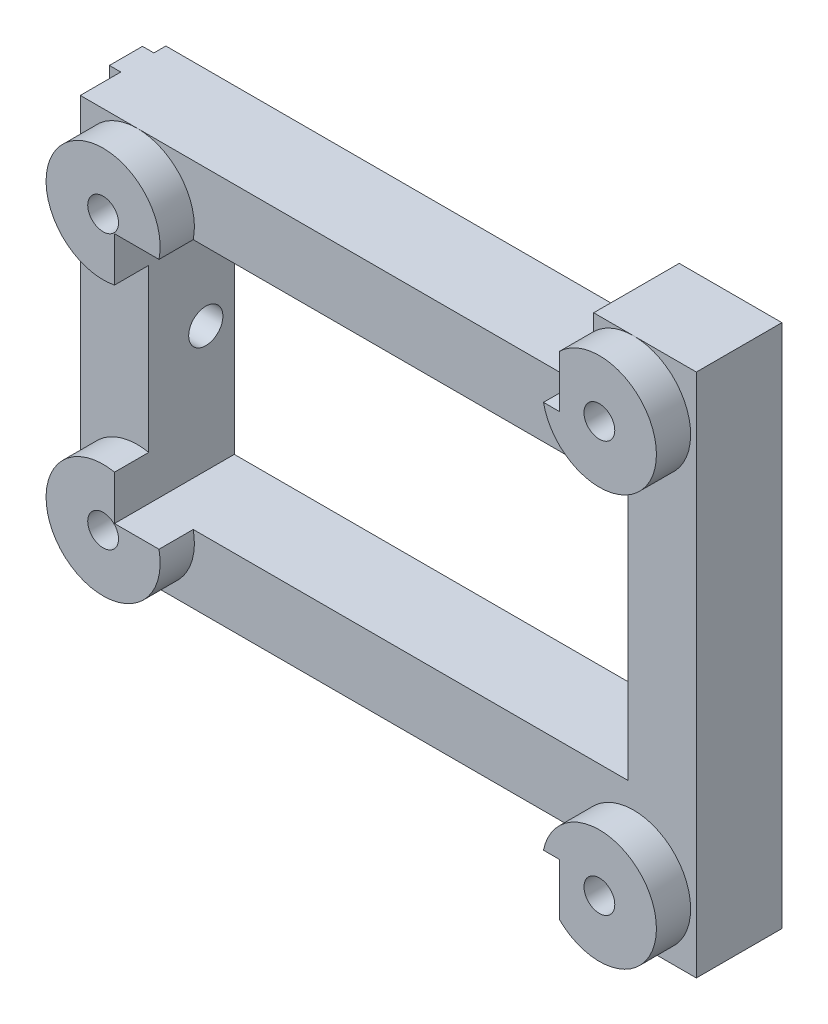
ISO-10303-21;
HEADER;
FILE_DESCRIPTION(('STEP AP214'),'2;1');
FILE_NAME('part.step','',(''),(''),'','','');
FILE_SCHEMA(('AUTOMOTIVE_DESIGN { 1 0 10303 214 1 1 1 1 }'));
ENDSEC;
DATA;
#1=APPLICATION_CONTEXT('core data for automotive mechanical design processes');
#2=APPLICATION_PROTOCOL_DEFINITION('international standard','automotive_design',2000,#1);
#3=PRODUCT_CONTEXT('',#1,'mechanical');
#4=PRODUCT('Part','Part','',(#3));
#5=PRODUCT_RELATED_PRODUCT_CATEGORY('part','',(#4));
#6=PRODUCT_DEFINITION_FORMATION('','',#4);
#7=PRODUCT_DEFINITION_CONTEXT('part definition',#1,'design');
#8=PRODUCT_DEFINITION('design','',#6,#7);
#9=PRODUCT_DEFINITION_SHAPE('','',#8);
#10=(LENGTH_UNIT() NAMED_UNIT(*) SI_UNIT(.MILLI.,.METRE.));
#11=(NAMED_UNIT(*) PLANE_ANGLE_UNIT() SI_UNIT($,.RADIAN.));
#12=(NAMED_UNIT(*) SI_UNIT($,.STERADIAN.) SOLID_ANGLE_UNIT());
#13=UNCERTAINTY_MEASURE_WITH_UNIT(LENGTH_MEASURE(1.E-05),#10,'distance_accuracy_value','');
#14=(GEOMETRIC_REPRESENTATION_CONTEXT(3) GLOBAL_UNCERTAINTY_ASSIGNED_CONTEXT((#13)) GLOBAL_UNIT_ASSIGNED_CONTEXT((#10,
#11,#12)) REPRESENTATION_CONTEXT('',''));
#15=CARTESIAN_POINT('',(0.,0.,0.));
#16=DIRECTION('',(0.,0.,1.));
#17=DIRECTION('',(1.,0.,0.));
#18=AXIS2_PLACEMENT_3D('',#15,#16,#17);
#19=CARTESIAN_POINT('',(-28.,17.,1.05));
#20=DIRECTION('',(0.,0.,1.));
#21=DIRECTION('',(0.,-1.,0.));
#22=AXIS2_PLACEMENT_3D('',#19,#20,#21);
#23=PLANE('',#22);
#24=DIRECTION('',(0.,-1.,0.));
#25=VECTOR('',#24,1.);
#26=CARTESIAN_POINT('',(-27.,17.,1.05));
#27=LINE('',#26,#25);
#28=CARTESIAN_POINT('',(-27.,17.,1.05));
#29=VERTEX_POINT('',#28);
#30=CARTESIAN_POINT('',(-27.,0.384057287393442,1.05));
#31=VERTEX_POINT('',#30);
#32=EDGE_CURVE('E250',#29,#31,#27,.T.);
#33=ORIENTED_EDGE('',*,*,#32,.T.);
#34=DIRECTION('',(-1.,0.,0.));
#35=VECTOR('',#34,1.);
#36=CARTESIAN_POINT('',(27.001,0.384057287393442,1.05));
#37=LINE('',#36,#35);
#38=CARTESIAN_POINT('',(-28.,0.384057287393443,1.05));
#39=VERTEX_POINT('',#38);
#40=EDGE_CURVE('E235',#39,#31,#37,.F.);
#41=ORIENTED_EDGE('',*,*,#40,.F.);
#42=DIRECTION('',(0.,-1.,0.));
#43=VECTOR('',#42,1.);
#44=CARTESIAN_POINT('',(-28.,17.,1.05));
#45=LINE('',#44,#43);
#46=CARTESIAN_POINT('',(-28.,17.,1.05));
#47=VERTEX_POINT('',#46);
#48=EDGE_CURVE('E458',#47,#39,#45,.T.);
#49=ORIENTED_EDGE('',*,*,#48,.F.);
#50=DIRECTION('',(1.,0.,0.));
#51=VECTOR('',#50,1.);
#52=CARTESIAN_POINT('',(-28.,17.,1.05));
#53=LINE('',#52,#51);
#54=EDGE_CURVE('E257',#47,#29,#53,.T.);
#55=ORIENTED_EDGE('',*,*,#54,.T.);
#56=EDGE_LOOP('',(#33,#41,#49,#55));
#57=FACE_BOUND('',#56,.T.);
#58=ADVANCED_FACE('F33',(#57),#23,.F.);
#59=CARTESIAN_POINT('',(-28.,17.,3.95));
#60=DIRECTION('',(0.,0.,-1.));
#61=DIRECTION('',(0.,1.,0.));
#62=AXIS2_PLACEMENT_3D('',#59,#60,#61);
#63=PLANE('',#62);
#64=DIRECTION('',(0.,1.,0.));
#65=VECTOR('',#64,1.);
#66=CARTESIAN_POINT('',(-27.,17.,3.95));
#67=LINE('',#66,#65);
#68=CARTESIAN_POINT('',(-27.,-17.,3.95));
#69=VERTEX_POINT('',#68);
#70=CARTESIAN_POINT('',(-27.,-0.384057287393425,3.95));
#71=VERTEX_POINT('',#70);
#72=EDGE_CURVE('E260',#69,#71,#67,.T.);
#73=ORIENTED_EDGE('',*,*,#72,.T.);
#74=DIRECTION('',(-1.,0.,0.));
#75=VECTOR('',#74,1.);
#76=CARTESIAN_POINT('',(27.001,-0.384057287393427,3.95));
#77=LINE('',#76,#75);
#78=CARTESIAN_POINT('',(-28.,-0.384057287393425,3.95));
#79=VERTEX_POINT('',#78);
#80=EDGE_CURVE('E499',#79,#71,#77,.F.);
#81=ORIENTED_EDGE('',*,*,#80,.F.);
#82=DIRECTION('',(0.,1.,0.));
#83=VECTOR('',#82,1.);
#84=CARTESIAN_POINT('',(-28.,17.,3.95));
#85=LINE('',#84,#83);
#86=CARTESIAN_POINT('',(-28.,-17.,3.95));
#87=VERTEX_POINT('',#86);
#88=EDGE_CURVE('E462',#87,#79,#85,.T.);
#89=ORIENTED_EDGE('',*,*,#88,.F.);
#90=DIRECTION('',(1.,0.,0.));
#91=VECTOR('',#90,1.);
#92=CARTESIAN_POINT('',(-28.,-17.,3.95));
#93=LINE('',#92,#91);
#94=EDGE_CURVE('E273',#87,#69,#93,.T.);
#95=ORIENTED_EDGE('',*,*,#94,.T.);
#96=EDGE_LOOP('',(#73,#81,#89,#95));
#97=FACE_BOUND('',#96,.T.);
#98=ADVANCED_FACE('F552',(#97),#63,.F.);
#99=CARTESIAN_POINT('',(-28.,0.,0.));
#100=DIRECTION('',(-1.,0.,0.));
#101=DIRECTION('',(0.,0.,1.));
#102=AXIS2_PLACEMENT_3D('',#99,#100,#101);
#103=PLANE('',#102);
#104=CARTESIAN_POINT('',(-28.,0.,2.5));
#105=DIRECTION('',(-1.,0.,0.));
#106=DIRECTION('',(0.,0.,1.));
#107=AXIS2_PLACEMENT_3D('',#104,#105,#106);
#108=CIRCLE('',#107,1.5);
#109=CARTESIAN_POINT('',(-28.,0.384057287393427,3.95));
#110=VERTEX_POINT('',#109);
#111=EDGE_CURVE('E240',#110,#39,#108,.T.);
#112=ORIENTED_EDGE('',*,*,#111,.F.);
#113=CARTESIAN_POINT('',(-28.,17.,3.95));
#114=VERTEX_POINT('',#113);
#115=EDGE_CURVE('E461',#110,#114,#85,.T.);
#116=ORIENTED_EDGE('',*,*,#115,.T.);
#117=DIRECTION('',(0.,0.,-1.));
#118=VECTOR('',#117,1.);
#119=CARTESIAN_POINT('',(-28.,17.,1.05));
#120=LINE('',#119,#118);
#121=EDGE_CURVE('E264',#114,#47,#120,.T.);
#122=ORIENTED_EDGE('',*,*,#121,.T.);
#123=ORIENTED_EDGE('',*,*,#48,.T.);
#124=EDGE_LOOP('',(#112,#116,#122,#123));
#125=FACE_BOUND('',#124,.T.);
#126=ADVANCED_FACE('F469',(#125),#103,.T.);
#127=CARTESIAN_POINT('',(0.,0.,7.5));
#128=DIRECTION('',(0.,0.,-1.));
#129=DIRECTION('',(-1.,0.,0.));
#130=AXIS2_PLACEMENT_3D('',#127,#128,#129);
#131=PLANE('',#130);
#132=CARTESIAN_POINT('',(-22.,-12.,7.5));
#133=DIRECTION('',(0.,0.,1.));
#134=DIRECTION('',(1.,0.,0.));
#135=AXIS2_PLACEMENT_3D('',#132,#133,#134);
#136=CIRCLE('',#135,5.);
#137=CARTESIAN_POINT('',(-21.,-7.10102051443364,7.5));
#138=VERTEX_POINT('',#137);
#139=CARTESIAN_POINT('',(-27.,-12.,7.5));
#140=VERTEX_POINT('',#139);
#141=EDGE_CURVE('E346',#138,#140,#136,.T.);
#142=ORIENTED_EDGE('',*,*,#141,.F.);
#143=DIRECTION('',(0.,1.,0.));
#144=VECTOR('',#143,1.);
#145=CARTESIAN_POINT('',(-21.,0.,7.5));
#146=LINE('',#145,#144);
#147=CARTESIAN_POINT('',(-21.,7.10102051443364,7.5));
#148=VERTEX_POINT('',#147);
#149=EDGE_CURVE('E443',#138,#148,#146,.T.);
#150=ORIENTED_EDGE('',*,*,#149,.T.);
#151=CARTESIAN_POINT('',(-22.,12.,7.5));
#152=DIRECTION('',(0.,0.,1.));
#153=DIRECTION('',(1.,0.,0.));
#154=AXIS2_PLACEMENT_3D('',#151,#152,#153);
#155=CIRCLE('',#154,5.);
#156=CARTESIAN_POINT('',(-27.,12.,7.5));
#157=VERTEX_POINT('',#156);
#158=EDGE_CURVE('E362',#157,#148,#155,.T.);
#159=ORIENTED_EDGE('',*,*,#158,.F.);
#160=DIRECTION('',(0.,-1.,0.));
#161=VECTOR('',#160,1.);
#162=CARTESIAN_POINT('',(-27.,-23.,7.5));
#163=LINE('',#162,#161);
#164=EDGE_CURVE('E381',#157,#140,#163,.T.);
#165=ORIENTED_EDGE('',*,*,#164,.T.);
#166=EDGE_LOOP('',(#142,#150,#159,#165));
#167=FACE_BOUND('',#166,.T.);
#168=ADVANCED_FACE('F548',(#167),#131,.F.);
#169=CARTESIAN_POINT('',(-27.,-23.,7.5));
#170=DIRECTION('',(1.,0.,0.));
#171=DIRECTION('',(0.,0.,-1.));
#172=AXIS2_PLACEMENT_3D('',#169,#170,#171);
#173=PLANE('',#172);
#174=CARTESIAN_POINT('',(-27.,-0.384057287393442,1.05));
#175=VERTEX_POINT('',#174);
#176=CARTESIAN_POINT('',(-27.,-17.,1.05));
#177=VERTEX_POINT('',#176);
#178=EDGE_CURVE('E253',#175,#177,#27,.T.);
#179=ORIENTED_EDGE('',*,*,#178,.F.);
#180=CARTESIAN_POINT('',(-27.,0.,2.5));
#181=DIRECTION('',(1.,0.,0.));
#182=DIRECTION('',(0.,0.,-1.));
#183=AXIS2_PLACEMENT_3D('',#180,#181,#182);
#184=CIRCLE('',#183,1.5);
#185=EDGE_CURVE('E238',#31,#175,#184,.F.);
#186=ORIENTED_EDGE('',*,*,#185,.F.);
#187=ORIENTED_EDGE('',*,*,#32,.F.);
#188=DIRECTION('',(0.,0.,1.));
#189=VECTOR('',#188,1.);
#190=CARTESIAN_POINT('',(-27.,17.,0.));
#191=LINE('',#190,#189);
#192=CARTESIAN_POINT('',(-27.,17.,0.));
#193=VERTEX_POINT('',#192);
#194=EDGE_CURVE('E279',#193,#29,#191,.T.);
#195=ORIENTED_EDGE('',*,*,#194,.F.);
#196=DIRECTION('',(0.,-1.,0.));
#197=VECTOR('',#196,1.);
#198=CARTESIAN_POINT('',(-27.,-23.,0.));
#199=LINE('',#198,#197);
#200=CARTESIAN_POINT('',(-27.,-17.,0.));
#201=VERTEX_POINT('',#200);
#202=EDGE_CURVE('E377',#193,#201,#199,.T.);
#203=ORIENTED_EDGE('',*,*,#202,.T.);
#204=DIRECTION('',(0.,0.,-1.));
#205=VECTOR('',#204,1.);
#206=CARTESIAN_POINT('',(-27.,-17.,10.5));
#207=LINE('',#206,#205);
#208=EDGE_CURVE('E309',#177,#201,#207,.T.);
#209=ORIENTED_EDGE('',*,*,#208,.F.);
#210=EDGE_LOOP('',(#179,#186,#187,#195,#203,#209));
#211=FACE_BOUND('',#210,.T.);
#212=ADVANCED_FACE('F35',(#211),#173,.F.);
#213=CARTESIAN_POINT('',(-27.,0.384057287393427,3.95));
#214=VERTEX_POINT('',#213);
#215=CARTESIAN_POINT('',(-27.,17.,3.95));
#216=VERTEX_POINT('',#215);
#217=EDGE_CURVE('E258',#214,#216,#67,.T.);
#218=ORIENTED_EDGE('',*,*,#217,.F.);
#219=CARTESIAN_POINT('',(-27.,0.,2.5));
#220=DIRECTION('',(1.,0.,0.));
#221=DIRECTION('',(0.,0.,-1.));
#222=AXIS2_PLACEMENT_3D('',#219,#220,#221);
#223=CIRCLE('',#222,1.5);
#224=EDGE_CURVE('E504',#71,#214,#223,.F.);
#225=ORIENTED_EDGE('',*,*,#224,.F.);
#226=ORIENTED_EDGE('',*,*,#72,.F.);
#227=CARTESIAN_POINT('',(-27.,-17.,7.5));
#228=VERTEX_POINT('',#227);
#229=EDGE_CURVE('E310',#228,#69,#207,.T.);
#230=ORIENTED_EDGE('',*,*,#229,.F.);
#231=EDGE_CURVE('E382',#140,#228,#163,.T.);
#232=ORIENTED_EDGE('',*,*,#231,.F.);
#233=ORIENTED_EDGE('',*,*,#164,.F.);
#234=CARTESIAN_POINT('',(-27.,17.,7.5));
#235=VERTEX_POINT('',#234);
#236=EDGE_CURVE('E378',#235,#157,#163,.T.);
#237=ORIENTED_EDGE('',*,*,#236,.F.);
#238=EDGE_CURVE('E282',#216,#235,#191,.T.);
#239=ORIENTED_EDGE('',*,*,#238,.F.);
#240=EDGE_LOOP('',(#218,#225,#226,#230,#232,#233,#237,#239));
#241=FACE_BOUND('',#240,.T.);
#242=ADVANCED_FACE('F639',(#241),#173,.F.);
#243=DIRECTION('',(1.,0.,0.));
#244=VECTOR('',#243,1.);
#245=CARTESIAN_POINT('',(0.,17.,7.5));
#246=LINE('',#245,#244);
#247=CARTESIAN_POINT('',(-22.,17.,7.5));
#248=VERTEX_POINT('',#247);
#249=EDGE_CURVE('E297',#235,#248,#246,.T.);
#250=ORIENTED_EDGE('',*,*,#249,.F.);
#251=ORIENTED_EDGE('',*,*,#236,.T.);
#252=EDGE_CURVE('E353',#248,#157,#155,.T.);
#253=ORIENTED_EDGE('',*,*,#252,.F.);
#254=EDGE_LOOP('',(#250,#251,#253));
#255=FACE_BOUND('',#254,.T.);
#256=ADVANCED_FACE('F655',(#255),#131,.F.);
#257=CARTESIAN_POINT('',(-17.1010205144336,11.,7.5));
#258=VERTEX_POINT('',#257);
#259=EDGE_CURVE('E365',#258,#248,#155,.T.);
#260=ORIENTED_EDGE('',*,*,#259,.F.);
#261=DIRECTION('',(1.,0.,0.));
#262=VECTOR('',#261,1.);
#263=CARTESIAN_POINT('',(0.,11.,7.5));
#264=LINE('',#263,#262);
#265=CARTESIAN_POINT('',(21.,11.,7.5));
#266=VERTEX_POINT('',#265);
#267=EDGE_CURVE('E453',#258,#266,#264,.T.);
#268=ORIENTED_EDGE('',*,*,#267,.T.);
#269=DIRECTION('',(0.,-1.,0.));
#270=VECTOR('',#269,1.);
#271=CARTESIAN_POINT('',(21.,0.,7.5));
#272=LINE('',#271,#270);
#273=CARTESIAN_POINT('',(21.,-11.,7.5));
#274=VERTEX_POINT('',#273);
#275=EDGE_CURVE('E262',#266,#274,#272,.T.);
#276=ORIENTED_EDGE('',*,*,#275,.T.);
#277=DIRECTION('',(-1.,0.,0.));
#278=VECTOR('',#277,1.);
#279=CARTESIAN_POINT('',(0.,-11.,7.5));
#280=LINE('',#279,#278);
#281=CARTESIAN_POINT('',(-17.1010205144336,-11.,7.5));
#282=VERTEX_POINT('',#281);
#283=EDGE_CURVE('E432',#274,#282,#280,.T.);
#284=ORIENTED_EDGE('',*,*,#283,.T.);
#285=CARTESIAN_POINT('',(-22.,-17.,7.5));
#286=VERTEX_POINT('',#285);
#287=EDGE_CURVE('E357',#286,#282,#136,.T.);
#288=ORIENTED_EDGE('',*,*,#287,.F.);
#289=DIRECTION('',(1.,0.,0.));
#290=VECTOR('',#289,1.);
#291=CARTESIAN_POINT('',(0.,-17.,7.5));
#292=LINE('',#291,#290);
#293=CARTESIAN_POINT('',(16.6010205144336,-17.,7.5));
#294=VERTEX_POINT('',#293);
#295=EDGE_CURVE('E325',#286,#294,#292,.T.);
#296=ORIENTED_EDGE('',*,*,#295,.T.);
#297=CARTESIAN_POINT('',(21.5,-18.,7.5));
#298=DIRECTION('',(0.,0.,1.));
#299=DIRECTION('',(1.,0.,0.));
#300=AXIS2_PLACEMENT_3D('',#297,#298,#299);
#301=CIRCLE('',#300,5.);
#302=CARTESIAN_POINT('',(21.5,-23.,7.5));
#303=VERTEX_POINT('',#302);
#304=EDGE_CURVE('E347',#303,#294,#301,.T.);
#305=ORIENTED_EDGE('',*,*,#304,.F.);
#306=DIRECTION('',(1.,0.,0.));
#307=VECTOR('',#306,1.);
#308=CARTESIAN_POINT('',(-27.,-23.,7.5));
#309=LINE('',#308,#307);
#310=CARTESIAN_POINT('',(27.,-23.,7.5));
#311=VERTEX_POINT('',#310);
#312=EDGE_CURVE('E380',#303,#311,#309,.T.);
#313=ORIENTED_EDGE('',*,*,#312,.T.);
#314=DIRECTION('',(0.,1.,0.));
#315=VECTOR('',#314,1.);
#316=CARTESIAN_POINT('',(27.,-23.,7.5));
#317=LINE('',#316,#315);
#318=CARTESIAN_POINT('',(27.,23.,7.5));
#319=VERTEX_POINT('',#318);
#320=EDGE_CURVE('E385',#311,#319,#317,.T.);
#321=ORIENTED_EDGE('',*,*,#320,.T.);
#322=DIRECTION('',(-1.,0.,0.));
#323=VECTOR('',#322,1.);
#324=CARTESIAN_POINT('',(-27.,23.,7.5));
#325=LINE('',#324,#323);
#326=CARTESIAN_POINT('',(21.5,23.,7.5));
#327=VERTEX_POINT('',#326);
#328=EDGE_CURVE('E388',#319,#327,#325,.T.);
#329=ORIENTED_EDGE('',*,*,#328,.T.);
#330=CARTESIAN_POINT('',(21.5,18.,7.5));
#331=DIRECTION('',(0.,0.,1.));
#332=DIRECTION('',(1.,0.,0.));
#333=AXIS2_PLACEMENT_3D('',#330,#331,#332);
#334=CIRCLE('',#333,5.);
#335=CARTESIAN_POINT('',(16.6010205144336,17.,7.5));
#336=VERTEX_POINT('',#335);
#337=EDGE_CURVE('E335',#336,#327,#334,.T.);
#338=ORIENTED_EDGE('',*,*,#337,.F.);
#339=EDGE_CURVE('E295',#248,#336,#246,.T.);
#340=ORIENTED_EDGE('',*,*,#339,.F.);
#341=EDGE_LOOP('',(#260,#268,#276,#284,#288,#296,#305,#313,#321,#329,#338,#340));
#342=FACE_BOUND('',#341,.T.);
#343=ADVANCED_FACE('F520',(#342),#131,.F.);
#344=CARTESIAN_POINT('',(18.,-21.5707142142714,7.5));
#345=VERTEX_POINT('',#344);
#346=EDGE_CURVE('E339',#345,#303,#301,.T.);
#347=ORIENTED_EDGE('',*,*,#346,.F.);
#348=DIRECTION('',(0.,-1.,0.));
#349=VECTOR('',#348,1.);
#350=CARTESIAN_POINT('',(18.,0.,7.5));
#351=LINE('',#350,#349);
#352=CARTESIAN_POINT('',(18.,-23.,7.5));
#353=VERTEX_POINT('',#352);
#354=EDGE_CURVE('E332',#345,#353,#351,.T.);
#355=ORIENTED_EDGE('',*,*,#354,.T.);
#356=EDGE_CURVE('E383',#353,#303,#309,.T.);
#357=ORIENTED_EDGE('',*,*,#356,.T.);
#358=EDGE_LOOP('',(#347,#355,#357));
#359=FACE_BOUND('',#358,.T.);
#360=ADVANCED_FACE('F682',(#359),#131,.F.);
#361=ORIENTED_EDGE('',*,*,#231,.T.);
#362=EDGE_CURVE('E328',#228,#286,#292,.T.);
#363=ORIENTED_EDGE('',*,*,#362,.T.);
#364=EDGE_CURVE('E354',#140,#286,#136,.T.);
#365=ORIENTED_EDGE('',*,*,#364,.F.);
#366=EDGE_LOOP('',(#361,#363,#365));
#367=FACE_BOUND('',#366,.T.);
#368=ADVANCED_FACE('F549',(#367),#131,.F.);
#369=CARTESIAN_POINT('',(-27.,-23.,7.5));
#370=DIRECTION('',(0.,1.,0.));
#371=DIRECTION('',(0.,0.,1.));
#372=AXIS2_PLACEMENT_3D('',#369,#370,#371);
#373=PLANE('',#372);
#374=ORIENTED_EDGE('',*,*,#356,.F.);
#375=DIRECTION('',(0.,0.,1.));
#376=VECTOR('',#375,1.);
#377=CARTESIAN_POINT('',(18.,-23.,10.5));
#378=LINE('',#377,#376);
#379=CARTESIAN_POINT('',(18.,-23.,0.));
#380=VERTEX_POINT('',#379);
#381=EDGE_CURVE('E304',#380,#353,#378,.T.);
#382=ORIENTED_EDGE('',*,*,#381,.F.);
#383=DIRECTION('',(1.,0.,0.));
#384=VECTOR('',#383,1.);
#385=CARTESIAN_POINT('',(-27.,-23.,0.));
#386=LINE('',#385,#384);
#387=CARTESIAN_POINT('',(27.,-23.,0.));
#388=VERTEX_POINT('',#387);
#389=EDGE_CURVE('E394',#380,#388,#386,.T.);
#390=ORIENTED_EDGE('',*,*,#389,.T.);
#391=DIRECTION('',(0.,0.,-1.));
#392=VECTOR('',#391,1.);
#393=CARTESIAN_POINT('',(27.,-23.,7.5));
#394=LINE('',#393,#392);
#395=EDGE_CURVE('E403',#311,#388,#394,.T.);
#396=ORIENTED_EDGE('',*,*,#395,.F.);
#397=ORIENTED_EDGE('',*,*,#312,.F.);
#398=EDGE_LOOP('',(#374,#382,#390,#396,#397));
#399=FACE_BOUND('',#398,.T.);
#400=ADVANCED_FACE('F678',(#399),#373,.F.);
#401=CARTESIAN_POINT('',(27.,-23.,7.5));
#402=DIRECTION('',(-1.,0.,0.));
#403=DIRECTION('',(0.,0.,1.));
#404=AXIS2_PLACEMENT_3D('',#401,#402,#403);
#405=PLANE('',#404);
#406=DIRECTION('',(0.,1.,0.));
#407=VECTOR('',#406,1.);
#408=CARTESIAN_POINT('',(27.,-23.,0.));
#409=LINE('',#408,#407);
#410=CARTESIAN_POINT('',(27.,23.,0.));
#411=VERTEX_POINT('',#410);
#412=EDGE_CURVE('E396',#388,#411,#409,.T.);
#413=ORIENTED_EDGE('',*,*,#412,.T.);
#414=DIRECTION('',(0.,0.,-1.));
#415=VECTOR('',#414,1.);
#416=CARTESIAN_POINT('',(27.,23.,7.5));
#417=LINE('',#416,#415);
#418=EDGE_CURVE('E391',#319,#411,#417,.T.);
#419=ORIENTED_EDGE('',*,*,#418,.F.);
#420=ORIENTED_EDGE('',*,*,#320,.F.);
#421=ORIENTED_EDGE('',*,*,#395,.T.);
#422=EDGE_LOOP('',(#413,#419,#420,#421));
#423=FACE_BOUND('',#422,.T.);
#424=ADVANCED_FACE('F673',(#423),#405,.F.);
#425=CARTESIAN_POINT('',(-27.,23.,7.5));
#426=DIRECTION('',(0.,-1.,0.));
#427=DIRECTION('',(0.,0.,-1.));
#428=AXIS2_PLACEMENT_3D('',#425,#426,#427);
#429=PLANE('',#428);
#430=DIRECTION('',(-1.,0.,0.));
#431=VECTOR('',#430,1.);
#432=CARTESIAN_POINT('',(-27.,23.,0.));
#433=LINE('',#432,#431);
#434=CARTESIAN_POINT('',(18.,23.,0.));
#435=VERTEX_POINT('',#434);
#436=EDGE_CURVE('E398',#411,#435,#433,.T.);
#437=ORIENTED_EDGE('',*,*,#436,.T.);
#438=DIRECTION('',(0.,0.,-1.));
#439=VECTOR('',#438,1.);
#440=CARTESIAN_POINT('',(18.,23.,0.));
#441=LINE('',#440,#439);
#442=CARTESIAN_POINT('',(18.,23.,7.5));
#443=VERTEX_POINT('',#442);
#444=EDGE_CURVE('E278',#443,#435,#441,.T.);
#445=ORIENTED_EDGE('',*,*,#444,.F.);
#446=EDGE_CURVE('E387',#327,#443,#325,.T.);
#447=ORIENTED_EDGE('',*,*,#446,.F.);
#448=ORIENTED_EDGE('',*,*,#328,.F.);
#449=ORIENTED_EDGE('',*,*,#418,.T.);
#450=EDGE_LOOP('',(#437,#445,#447,#448,#449));
#451=FACE_BOUND('',#450,.T.);
#452=ADVANCED_FACE('F545',(#451),#429,.F.);
#453=ORIENTED_EDGE('',*,*,#446,.T.);
#454=DIRECTION('',(0.,-1.,0.));
#455=VECTOR('',#454,1.);
#456=CARTESIAN_POINT('',(18.,0.,7.5));
#457=LINE('',#456,#455);
#458=CARTESIAN_POINT('',(18.,21.5707142142714,7.5));
#459=VERTEX_POINT('',#458);
#460=EDGE_CURVE('E301',#443,#459,#457,.T.);
#461=ORIENTED_EDGE('',*,*,#460,.T.);
#462=EDGE_CURVE('E340',#327,#459,#334,.T.);
#463=ORIENTED_EDGE('',*,*,#462,.F.);
#464=EDGE_LOOP('',(#453,#461,#463));
#465=FACE_BOUND('',#464,.T.);
#466=ADVANCED_FACE('F536',(#465),#131,.F.);
#467=CARTESIAN_POINT('',(0.,0.,0.));
#468=DIRECTION('',(0.,0.,-1.));
#469=DIRECTION('',(-1.,0.,0.));
#470=AXIS2_PLACEMENT_3D('',#467,#468,#469);
#471=PLANE('',#470);
#472=DIRECTION('',(0.,-1.,0.));
#473=VECTOR('',#472,1.);
#474=CARTESIAN_POINT('',(-21.,11.,0.));
#475=LINE('',#474,#473);
#476=CARTESIAN_POINT('',(-21.,11.,0.));
#477=VERTEX_POINT('',#476);
#478=CARTESIAN_POINT('',(-21.,-11.,0.));
#479=VERTEX_POINT('',#478);
#480=EDGE_CURVE('E505',#477,#479,#475,.T.);
#481=ORIENTED_EDGE('',*,*,#480,.T.);
#482=DIRECTION('',(1.,0.,0.));
#483=VECTOR('',#482,1.);
#484=CARTESIAN_POINT('',(-21.,-11.,0.));
#485=LINE('',#484,#483);
#486=CARTESIAN_POINT('',(21.,-11.,0.));
#487=VERTEX_POINT('',#486);
#488=EDGE_CURVE('E508',#479,#487,#485,.T.);
#489=ORIENTED_EDGE('',*,*,#488,.T.);
#490=DIRECTION('',(0.,1.,0.));
#491=VECTOR('',#490,1.);
#492=CARTESIAN_POINT('',(21.,11.,0.));
#493=LINE('',#492,#491);
#494=CARTESIAN_POINT('',(21.,11.,0.));
#495=VERTEX_POINT('',#494);
#496=EDGE_CURVE('E56',#487,#495,#493,.T.);
#497=ORIENTED_EDGE('',*,*,#496,.T.);
#498=DIRECTION('',(-1.,0.,0.));
#499=VECTOR('',#498,1.);
#500=CARTESIAN_POINT('',(-21.,11.,0.));
#501=LINE('',#500,#499);
#502=EDGE_CURVE('E512',#495,#477,#501,.T.);
#503=ORIENTED_EDGE('',*,*,#502,.T.);
#504=EDGE_LOOP('',(#481,#489,#497,#503));
#505=FACE_BOUND('',#504,.T.);
#506=DIRECTION('',(0.,1.,0.));
#507=VECTOR('',#506,1.);
#508=CARTESIAN_POINT('',(18.,17.,0.));
#509=LINE('',#508,#507);
#510=CARTESIAN_POINT('',(18.,17.,0.));
#511=VERTEX_POINT('',#510);
#512=EDGE_CURVE('E289',#511,#435,#509,.T.);
#513=ORIENTED_EDGE('',*,*,#512,.T.);
#514=ORIENTED_EDGE('',*,*,#436,.F.);
#515=ORIENTED_EDGE('',*,*,#412,.F.);
#516=ORIENTED_EDGE('',*,*,#389,.F.);
#517=DIRECTION('',(0.,-1.,0.));
#518=VECTOR('',#517,1.);
#519=CARTESIAN_POINT('',(18.,-17.,0.));
#520=LINE('',#519,#518);
#521=CARTESIAN_POINT('',(18.,-17.,0.));
#522=VERTEX_POINT('',#521);
#523=EDGE_CURVE('E318',#522,#380,#520,.T.);
#524=ORIENTED_EDGE('',*,*,#523,.F.);
#525=DIRECTION('',(1.,0.,0.));
#526=VECTOR('',#525,1.);
#527=CARTESIAN_POINT('',(18.,-17.,0.));
#528=LINE('',#527,#526);
#529=EDGE_CURVE('E313',#201,#522,#528,.T.);
#530=ORIENTED_EDGE('',*,*,#529,.F.);
#531=ORIENTED_EDGE('',*,*,#202,.F.);
#532=DIRECTION('',(-1.,0.,0.));
#533=VECTOR('',#532,1.);
#534=CARTESIAN_POINT('',(-27.,17.,0.));
#535=LINE('',#534,#533);
#536=EDGE_CURVE('E285',#511,#193,#535,.T.);
#537=ORIENTED_EDGE('',*,*,#536,.F.);
#538=EDGE_LOOP('',(#513,#514,#515,#516,#524,#530,#531,#537));
#539=FACE_BOUND('',#538,.T.);
#540=CARTESIAN_POINT('',(-22.,12.,0.));
#541=DIRECTION('',(0.,0.,1.));
#542=DIRECTION('',(1.,0.,0.));
#543=AXIS2_PLACEMENT_3D('',#540,#541,#542);
#544=CIRCLE('',#543,1.35);
#545=CARTESIAN_POINT('',(-20.65,12.,0.));
#546=VERTEX_POINT('',#545);
#547=EDGE_CURVE('E366',#546,#546,#544,.T.);
#548=ORIENTED_EDGE('',*,*,#547,.T.);
#549=EDGE_LOOP('',(#548));
#550=FACE_BOUND('',#549,.T.);
#551=CARTESIAN_POINT('',(21.5,18.,0.));
#552=DIRECTION('',(0.,0.,1.));
#553=DIRECTION('',(1.,0.,0.));
#554=AXIS2_PLACEMENT_3D('',#551,#552,#553);
#555=CIRCLE('',#554,1.35);
#556=CARTESIAN_POINT('',(22.85,18.,0.));
#557=VERTEX_POINT('',#556);
#558=EDGE_CURVE('E370',#557,#557,#555,.T.);
#559=ORIENTED_EDGE('',*,*,#558,.T.);
#560=EDGE_LOOP('',(#559));
#561=FACE_BOUND('',#560,.T.);
#562=CARTESIAN_POINT('',(21.5,-18.,0.));
#563=DIRECTION('',(0.,0.,1.));
#564=DIRECTION('',(1.,0.,0.));
#565=AXIS2_PLACEMENT_3D('',#562,#563,#564);
#566=CIRCLE('',#565,1.35);
#567=CARTESIAN_POINT('',(22.85,-18.,0.));
#568=VERTEX_POINT('',#567);
#569=EDGE_CURVE('E361',#568,#568,#566,.T.);
#570=ORIENTED_EDGE('',*,*,#569,.T.);
#571=EDGE_LOOP('',(#570));
#572=FACE_BOUND('',#571,.T.);
#573=CARTESIAN_POINT('',(-22.,-12.,0.));
#574=DIRECTION('',(0.,0.,1.));
#575=DIRECTION('',(1.,0.,0.));
#576=AXIS2_PLACEMENT_3D('',#573,#574,#575);
#577=CIRCLE('',#576,1.35);
#578=CARTESIAN_POINT('',(-20.65,-12.,0.));
#579=VERTEX_POINT('',#578);
#580=EDGE_CURVE('E369',#579,#579,#577,.T.);
#581=ORIENTED_EDGE('',*,*,#580,.T.);
#582=EDGE_LOOP('',(#581));
#583=FACE_BOUND('',#582,.T.);
#584=ADVANCED_FACE('F483',(#505,#539,#550,#561,#572,#583),#471,.T.);
#585=CARTESIAN_POINT('',(-22.,-12.,0.));
#586=DIRECTION('',(0.,0.,1.));
#587=DIRECTION('',(1.,0.,0.));
#588=AXIS2_PLACEMENT_3D('',#585,#586,#587);
#589=CYLINDRICAL_SURFACE('',#588,1.35);
#590=ORIENTED_EDGE('',*,*,#580,.F.);
#591=EDGE_LOOP('',(#590));
#592=FACE_BOUND('',#591,.T.);
#593=CARTESIAN_POINT('',(-22.,-12.,10.5));
#594=DIRECTION('',(0.,0.,-1.));
#595=DIRECTION('',(-1.,0.,0.));
#596=AXIS2_PLACEMENT_3D('',#593,#594,#595);
#597=CIRCLE('',#596,1.35);
#598=CARTESIAN_POINT('',(-23.35,-12.,10.5));
#599=VERTEX_POINT('',#598);
#600=EDGE_CURVE('E622',#599,#599,#597,.T.);
#601=ORIENTED_EDGE('',*,*,#600,.F.);
#602=EDGE_LOOP('',(#601));
#603=FACE_BOUND('',#602,.T.);
#604=ADVANCED_FACE('F535',(#592,#603),#589,.F.);
#605=CARTESIAN_POINT('',(21.5,-18.,0.));
#606=DIRECTION('',(0.,0.,1.));
#607=DIRECTION('',(1.,0.,0.));
#608=AXIS2_PLACEMENT_3D('',#605,#606,#607);
#609=CYLINDRICAL_SURFACE('',#608,1.35);
#610=ORIENTED_EDGE('',*,*,#569,.F.);
#611=EDGE_LOOP('',(#610));
#612=FACE_BOUND('',#611,.T.);
#613=CARTESIAN_POINT('',(21.5,-18.,10.5));
#614=DIRECTION('',(0.,0.,-1.));
#615=DIRECTION('',(-1.,0.,0.));
#616=AXIS2_PLACEMENT_3D('',#613,#614,#615);
#617=CIRCLE('',#616,1.35);
#618=CARTESIAN_POINT('',(20.15,-18.,10.5));
#619=VERTEX_POINT('',#618);
#620=EDGE_CURVE('E621',#619,#619,#617,.T.);
#621=ORIENTED_EDGE('',*,*,#620,.F.);
#622=EDGE_LOOP('',(#621));
#623=FACE_BOUND('',#622,.T.);
#624=ADVANCED_FACE('F542',(#612,#623),#609,.F.);
#625=CARTESIAN_POINT('',(21.5,18.,0.));
#626=DIRECTION('',(0.,0.,1.));
#627=DIRECTION('',(1.,0.,0.));
#628=AXIS2_PLACEMENT_3D('',#625,#626,#627);
#629=CYLINDRICAL_SURFACE('',#628,1.35);
#630=ORIENTED_EDGE('',*,*,#558,.F.);
#631=EDGE_LOOP('',(#630));
#632=FACE_BOUND('',#631,.T.);
#633=CARTESIAN_POINT('',(21.5,18.,10.5));
#634=DIRECTION('',(0.,0.,-1.));
#635=DIRECTION('',(-1.,0.,0.));
#636=AXIS2_PLACEMENT_3D('',#633,#634,#635);
#637=CIRCLE('',#636,1.35);
#638=CARTESIAN_POINT('',(20.15,18.,10.5));
#639=VERTEX_POINT('',#638);
#640=EDGE_CURVE('E502',#639,#639,#637,.T.);
#641=ORIENTED_EDGE('',*,*,#640,.F.);
#642=EDGE_LOOP('',(#641));
#643=FACE_BOUND('',#642,.T.);
#644=ADVANCED_FACE('F608',(#632,#643),#629,.F.);
#645=CARTESIAN_POINT('',(-22.,12.,0.));
#646=DIRECTION('',(0.,0.,1.));
#647=DIRECTION('',(1.,0.,0.));
#648=AXIS2_PLACEMENT_3D('',#645,#646,#647);
#649=CYLINDRICAL_SURFACE('',#648,1.35);
#650=ORIENTED_EDGE('',*,*,#547,.F.);
#651=EDGE_LOOP('',(#650));
#652=FACE_BOUND('',#651,.T.);
#653=CARTESIAN_POINT('',(-22.,12.,10.5));
#654=DIRECTION('',(0.,0.,-1.));
#655=DIRECTION('',(-1.,0.,0.));
#656=AXIS2_PLACEMENT_3D('',#653,#654,#655);
#657=CIRCLE('',#656,1.35);
#658=CARTESIAN_POINT('',(-23.35,12.,10.5));
#659=VERTEX_POINT('',#658);
#660=EDGE_CURVE('E625',#659,#659,#657,.T.);
#661=ORIENTED_EDGE('',*,*,#660,.F.);
#662=EDGE_LOOP('',(#661));
#663=FACE_BOUND('',#662,.T.);
#664=ADVANCED_FACE('F602',(#652,#663),#649,.F.);
#665=CARTESIAN_POINT('',(-22.,12.,10.5));
#666=DIRECTION('',(0.,0.,1.));
#667=DIRECTION('',(1.,0.,0.));
#668=AXIS2_PLACEMENT_3D('',#665,#666,#667);
#669=PLANE('',#668);
#670=ORIENTED_EDGE('',*,*,#660,.T.);
#671=EDGE_LOOP('',(#670));
#672=FACE_BOUND('',#671,.T.);
#673=DIRECTION('',(0.,-1.,0.));
#674=VECTOR('',#673,1.);
#675=CARTESIAN_POINT('',(-21.,12.,10.5));
#676=LINE('',#675,#674);
#677=CARTESIAN_POINT('',(-21.,11.,10.5));
#678=VERTEX_POINT('',#677);
#679=CARTESIAN_POINT('',(-21.,7.10102051443364,10.5));
#680=VERTEX_POINT('',#679);
#681=EDGE_CURVE('E449',#678,#680,#676,.T.);
#682=ORIENTED_EDGE('',*,*,#681,.F.);
#683=DIRECTION('',(-1.,0.,0.));
#684=VECTOR('',#683,1.);
#685=CARTESIAN_POINT('',(-22.,11.,10.5));
#686=LINE('',#685,#684);
#687=CARTESIAN_POINT('',(-17.1010205144336,11.,10.5));
#688=VERTEX_POINT('',#687);
#689=EDGE_CURVE('E451',#688,#678,#686,.T.);
#690=ORIENTED_EDGE('',*,*,#689,.F.);
#691=CARTESIAN_POINT('',(-22.,12.,10.5));
#692=DIRECTION('',(0.,0.,1.));
#693=DIRECTION('',(1.,0.,0.));
#694=AXIS2_PLACEMENT_3D('',#691,#692,#693);
#695=CIRCLE('',#694,5.);
#696=EDGE_CURVE('E358',#688,#680,#695,.T.);
#697=ORIENTED_EDGE('',*,*,#696,.T.);
#698=EDGE_LOOP('',(#682,#690,#697));
#699=FACE_BOUND('',#698,.T.);
#700=ADVANCED_FACE('F532',(#672,#699),#669,.T.);
#701=CARTESIAN_POINT('',(-22.,12.,10.5));
#702=DIRECTION('',(0.,0.,-1.));
#703=DIRECTION('',(-1.,0.,0.));
#704=AXIS2_PLACEMENT_3D('',#701,#702,#703);
#705=CYLINDRICAL_SURFACE('',#704,5.);
#706=ORIENTED_EDGE('',*,*,#158,.T.);
#707=DIRECTION('',(0.,0.,-1.));
#708=VECTOR('',#707,1.);
#709=CARTESIAN_POINT('',(-21.,7.10102051443364,10.5));
#710=LINE('',#709,#708);
#711=EDGE_CURVE('E446',#148,#680,#710,.F.);
#712=ORIENTED_EDGE('',*,*,#711,.T.);
#713=ORIENTED_EDGE('',*,*,#696,.F.);
#714=DIRECTION('',(0.,0.,-1.));
#715=VECTOR('',#714,1.);
#716=CARTESIAN_POINT('',(-17.1010205144336,11.,10.5));
#717=LINE('',#716,#715);
#718=EDGE_CURVE('E11',#688,#258,#717,.T.);
#719=ORIENTED_EDGE('',*,*,#718,.T.);
#720=ORIENTED_EDGE('',*,*,#259,.T.);
#721=ORIENTED_EDGE('',*,*,#252,.T.);
#722=EDGE_LOOP('',(#706,#712,#713,#719,#720,#721));
#723=FACE_BOUND('',#722,.T.);
#724=ADVANCED_FACE('F528',(#723),#705,.T.);
#725=CARTESIAN_POINT('',(-22.,-12.,10.5));
#726=DIRECTION('',(0.,0.,-1.));
#727=DIRECTION('',(-1.,0.,0.));
#728=AXIS2_PLACEMENT_3D('',#725,#726,#727);
#729=CYLINDRICAL_SURFACE('',#728,5.);
#730=CARTESIAN_POINT('',(-22.,-12.,10.5));
#731=DIRECTION('',(0.,0.,1.));
#732=DIRECTION('',(1.,0.,0.));
#733=AXIS2_PLACEMENT_3D('',#730,#731,#732);
#734=CIRCLE('',#733,5.);
#735=CARTESIAN_POINT('',(-21.,-7.10102051443364,10.5));
#736=VERTEX_POINT('',#735);
#737=CARTESIAN_POINT('',(-17.1010205144336,-11.,10.5));
#738=VERTEX_POINT('',#737);
#739=EDGE_CURVE('E350',#736,#738,#734,.T.);
#740=ORIENTED_EDGE('',*,*,#739,.F.);
#741=DIRECTION('',(0.,0.,-1.));
#742=VECTOR('',#741,1.);
#743=CARTESIAN_POINT('',(-21.,-7.10102051443364,10.5));
#744=LINE('',#743,#742);
#745=EDGE_CURVE('E419',#736,#138,#744,.T.);
#746=ORIENTED_EDGE('',*,*,#745,.T.);
#747=ORIENTED_EDGE('',*,*,#141,.T.);
#748=ORIENTED_EDGE('',*,*,#364,.T.);
#749=ORIENTED_EDGE('',*,*,#287,.T.);
#750=DIRECTION('',(0.,0.,-1.));
#751=VECTOR('',#750,1.);
#752=CARTESIAN_POINT('',(-17.1010205144336,-11.,10.5));
#753=LINE('',#752,#751);
#754=EDGE_CURVE('E426',#282,#738,#753,.F.);
#755=ORIENTED_EDGE('',*,*,#754,.T.);
#756=EDGE_LOOP('',(#740,#746,#747,#748,#749,#755));
#757=FACE_BOUND('',#756,.T.);
#758=ADVANCED_FACE('F430',(#757),#729,.T.);
#759=CARTESIAN_POINT('',(-22.,-12.,10.5));
#760=DIRECTION('',(0.,0.,1.));
#761=DIRECTION('',(1.,0.,0.));
#762=AXIS2_PLACEMENT_3D('',#759,#760,#761);
#763=PLANE('',#762);
#764=ORIENTED_EDGE('',*,*,#600,.T.);
#765=EDGE_LOOP('',(#764));
#766=FACE_BOUND('',#765,.T.);
#767=DIRECTION('',(0.,-1.,0.));
#768=VECTOR('',#767,1.);
#769=CARTESIAN_POINT('',(-21.,-12.,10.5));
#770=LINE('',#769,#768);
#771=CARTESIAN_POINT('',(-21.,-11.,10.5));
#772=VERTEX_POINT('',#771);
#773=EDGE_CURVE('E41',#736,#772,#770,.T.);
#774=ORIENTED_EDGE('',*,*,#773,.F.);
#775=ORIENTED_EDGE('',*,*,#739,.T.);
#776=DIRECTION('',(1.,0.,0.));
#777=VECTOR('',#776,1.);
#778=CARTESIAN_POINT('',(-22.,-11.,10.5));
#779=LINE('',#778,#777);
#780=EDGE_CURVE('E409',#772,#738,#779,.T.);
#781=ORIENTED_EDGE('',*,*,#780,.F.);
#782=EDGE_LOOP('',(#774,#775,#781));
#783=FACE_BOUND('',#782,.T.);
#784=ADVANCED_FACE('F422',(#766,#783),#763,.T.);
#785=CARTESIAN_POINT('',(21.5,-18.,10.5));
#786=DIRECTION('',(0.,0.,-1.));
#787=DIRECTION('',(-1.,0.,0.));
#788=AXIS2_PLACEMENT_3D('',#785,#786,#787);
#789=CYLINDRICAL_SURFACE('',#788,5.);
#790=CARTESIAN_POINT('',(21.5,-18.,10.5));
#791=DIRECTION('',(0.,0.,1.));
#792=DIRECTION('',(1.,0.,0.));
#793=AXIS2_PLACEMENT_3D('',#790,#791,#792);
#794=CIRCLE('',#793,5.);
#795=CARTESIAN_POINT('',(18.,-21.5707142142714,10.5));
#796=VERTEX_POINT('',#795);
#797=CARTESIAN_POINT('',(16.6010205144336,-17.,10.5));
#798=VERTEX_POINT('',#797);
#799=EDGE_CURVE('E343',#796,#798,#794,.T.);
#800=ORIENTED_EDGE('',*,*,#799,.F.);
#801=DIRECTION('',(0.,0.,-1.));
#802=VECTOR('',#801,1.);
#803=CARTESIAN_POINT('',(18.,-21.5707142142714,10.5));
#804=LINE('',#803,#802);
#805=EDGE_CURVE('E329',#796,#345,#804,.T.);
#806=ORIENTED_EDGE('',*,*,#805,.T.);
#807=ORIENTED_EDGE('',*,*,#346,.T.);
#808=ORIENTED_EDGE('',*,*,#304,.T.);
#809=DIRECTION('',(0.,0.,-1.));
#810=VECTOR('',#809,1.);
#811=CARTESIAN_POINT('',(16.6010205144336,-17.,10.5));
#812=LINE('',#811,#810);
#813=EDGE_CURVE('E320',#294,#798,#812,.F.);
#814=ORIENTED_EDGE('',*,*,#813,.T.);
#815=EDGE_LOOP('',(#800,#806,#807,#808,#814));
#816=FACE_BOUND('',#815,.T.);
#817=ADVANCED_FACE('F590',(#816),#789,.T.);
#818=CARTESIAN_POINT('',(21.5,-18.,10.5));
#819=DIRECTION('',(0.,0.,1.));
#820=DIRECTION('',(1.,0.,0.));
#821=AXIS2_PLACEMENT_3D('',#818,#819,#820);
#822=PLANE('',#821);
#823=ORIENTED_EDGE('',*,*,#620,.T.);
#824=EDGE_LOOP('',(#823));
#825=FACE_BOUND('',#824,.T.);
#826=DIRECTION('',(0.,-1.,0.));
#827=VECTOR('',#826,1.);
#828=CARTESIAN_POINT('',(18.,-17.,10.5));
#829=LINE('',#828,#827);
#830=CARTESIAN_POINT('',(18.,-17.,10.5));
#831=VERTEX_POINT('',#830);
#832=EDGE_CURVE('E316',#831,#796,#829,.T.);
#833=ORIENTED_EDGE('',*,*,#832,.T.);
#834=ORIENTED_EDGE('',*,*,#799,.T.);
#835=DIRECTION('',(-1.,0.,0.));
#836=VECTOR('',#835,1.);
#837=CARTESIAN_POINT('',(18.,-17.,10.5));
#838=LINE('',#837,#836);
#839=EDGE_CURVE('E307',#831,#798,#838,.T.);
#840=ORIENTED_EDGE('',*,*,#839,.F.);
#841=EDGE_LOOP('',(#833,#834,#840));
#842=FACE_BOUND('',#841,.T.);
#843=ADVANCED_FACE('F586',(#825,#842),#822,.T.);
#844=CARTESIAN_POINT('',(21.5,18.,10.5));
#845=DIRECTION('',(0.,0.,-1.));
#846=DIRECTION('',(-1.,0.,0.));
#847=AXIS2_PLACEMENT_3D('',#844,#845,#846);
#848=CYLINDRICAL_SURFACE('',#847,5.);
#849=ORIENTED_EDGE('',*,*,#462,.T.);
#850=DIRECTION('',(0.,0.,-1.));
#851=VECTOR('',#850,1.);
#852=CARTESIAN_POINT('',(18.,21.5707142142714,10.5));
#853=LINE('',#852,#851);
#854=CARTESIAN_POINT('',(18.,21.5707142142714,10.5));
#855=VERTEX_POINT('',#854);
#856=EDGE_CURVE('E298',#459,#855,#853,.F.);
#857=ORIENTED_EDGE('',*,*,#856,.T.);
#858=CARTESIAN_POINT('',(21.5,18.,10.5));
#859=DIRECTION('',(0.,0.,1.));
#860=DIRECTION('',(1.,0.,0.));
#861=AXIS2_PLACEMENT_3D('',#858,#859,#860);
#862=CIRCLE('',#861,5.);
#863=CARTESIAN_POINT('',(16.6010205144336,17.,10.5));
#864=VERTEX_POINT('',#863);
#865=EDGE_CURVE('E336',#864,#855,#862,.T.);
#866=ORIENTED_EDGE('',*,*,#865,.F.);
#867=DIRECTION('',(0.,0.,-1.));
#868=VECTOR('',#867,1.);
#869=CARTESIAN_POINT('',(16.6010205144336,17.,10.5));
#870=LINE('',#869,#868);
#871=EDGE_CURVE('E292',#336,#864,#870,.F.);
#872=ORIENTED_EDGE('',*,*,#871,.F.);
#873=ORIENTED_EDGE('',*,*,#337,.T.);
#874=EDGE_LOOP('',(#849,#857,#866,#872,#873));
#875=FACE_BOUND('',#874,.T.);
#876=ADVANCED_FACE('F582',(#875),#848,.T.);
#877=CARTESIAN_POINT('',(21.5,18.,10.5));
#878=DIRECTION('',(0.,0.,1.));
#879=DIRECTION('',(1.,0.,0.));
#880=AXIS2_PLACEMENT_3D('',#877,#878,#879);
#881=PLANE('',#880);
#882=ORIENTED_EDGE('',*,*,#640,.T.);
#883=EDGE_LOOP('',(#882));
#884=FACE_BOUND('',#883,.T.);
#885=DIRECTION('',(0.,1.,0.));
#886=VECTOR('',#885,1.);
#887=CARTESIAN_POINT('',(18.,17.,10.5));
#888=LINE('',#887,#886);
#889=CARTESIAN_POINT('',(18.,17.,10.5));
#890=VERTEX_POINT('',#889);
#891=EDGE_CURVE('E287',#890,#855,#888,.T.);
#892=ORIENTED_EDGE('',*,*,#891,.F.);
#893=DIRECTION('',(-1.,0.,0.));
#894=VECTOR('',#893,1.);
#895=CARTESIAN_POINT('',(21.5,17.,10.5));
#896=LINE('',#895,#894);
#897=EDGE_CURVE('E406',#890,#864,#896,.T.);
#898=ORIENTED_EDGE('',*,*,#897,.T.);
#899=ORIENTED_EDGE('',*,*,#865,.T.);
#900=EDGE_LOOP('',(#892,#898,#899));
#901=FACE_BOUND('',#900,.T.);
#902=ADVANCED_FACE('F578',(#884,#901),#881,.T.);
#903=CARTESIAN_POINT('',(18.,-17.,10.5));
#904=DIRECTION('',(1.,0.,0.));
#905=DIRECTION('',(0.,0.,-1.));
#906=AXIS2_PLACEMENT_3D('',#903,#904,#905);
#907=PLANE('',#906);
#908=ORIENTED_EDGE('',*,*,#805,.F.);
#909=ORIENTED_EDGE('',*,*,#832,.F.);
#910=DIRECTION('',(0.,0.,1.));
#911=VECTOR('',#910,1.);
#912=CARTESIAN_POINT('',(18.,-17.,10.5));
#913=LINE('',#912,#911);
#914=EDGE_CURVE('E305',#522,#831,#913,.T.);
#915=ORIENTED_EDGE('',*,*,#914,.F.);
#916=ORIENTED_EDGE('',*,*,#523,.T.);
#917=ORIENTED_EDGE('',*,*,#381,.T.);
#918=ORIENTED_EDGE('',*,*,#354,.F.);
#919=EDGE_LOOP('',(#908,#909,#915,#916,#917,#918));
#920=FACE_BOUND('',#919,.T.);
#921=ADVANCED_FACE('F575',(#920),#907,.F.);
#922=CARTESIAN_POINT('',(0.,-17.,0.));
#923=DIRECTION('',(0.,1.,0.));
#924=DIRECTION('',(0.,0.,1.));
#925=AXIS2_PLACEMENT_3D('',#922,#923,#924);
#926=PLANE('',#925);
#927=ORIENTED_EDGE('',*,*,#229,.T.);
#928=ORIENTED_EDGE('',*,*,#94,.F.);
#929=DIRECTION('',(0.,0.,1.));
#930=VECTOR('',#929,1.);
#931=CARTESIAN_POINT('',(-28.,-17.,1.05));
#932=LINE('',#931,#930);
#933=CARTESIAN_POINT('',(-28.,-17.,1.05));
#934=VERTEX_POINT('',#933);
#935=EDGE_CURVE('E460',#934,#87,#932,.T.);
#936=ORIENTED_EDGE('',*,*,#935,.F.);
#937=DIRECTION('',(1.,0.,0.));
#938=VECTOR('',#937,1.);
#939=CARTESIAN_POINT('',(-28.,-17.,1.05));
#940=LINE('',#939,#938);
#941=EDGE_CURVE('E275',#934,#177,#940,.T.);
#942=ORIENTED_EDGE('',*,*,#941,.T.);
#943=ORIENTED_EDGE('',*,*,#208,.T.);
#944=ORIENTED_EDGE('',*,*,#529,.T.);
#945=ORIENTED_EDGE('',*,*,#914,.T.);
#946=ORIENTED_EDGE('',*,*,#839,.T.);
#947=ORIENTED_EDGE('',*,*,#813,.F.);
#948=ORIENTED_EDGE('',*,*,#295,.F.);
#949=ORIENTED_EDGE('',*,*,#362,.F.);
#950=EDGE_LOOP('',(#927,#928,#936,#942,#943,#944,#945,#946,#947,#948,#949));
#951=FACE_BOUND('',#950,.T.);
#952=ADVANCED_FACE('F488',(#951),#926,.F.);
#953=CARTESIAN_POINT('',(18.,17.,0.));
#954=DIRECTION('',(1.,0.,0.));
#955=DIRECTION('',(0.,0.,-1.));
#956=AXIS2_PLACEMENT_3D('',#953,#954,#955);
#957=PLANE('',#956);
#958=ORIENTED_EDGE('',*,*,#444,.T.);
#959=ORIENTED_EDGE('',*,*,#512,.F.);
#960=DIRECTION('',(0.,0.,-1.));
#961=VECTOR('',#960,1.);
#962=CARTESIAN_POINT('',(18.,17.,0.));
#963=LINE('',#962,#961);
#964=EDGE_CURVE('E281',#890,#511,#963,.T.);
#965=ORIENTED_EDGE('',*,*,#964,.F.);
#966=ORIENTED_EDGE('',*,*,#891,.T.);
#967=ORIENTED_EDGE('',*,*,#856,.F.);
#968=ORIENTED_EDGE('',*,*,#460,.F.);
#969=EDGE_LOOP('',(#958,#959,#965,#966,#967,#968));
#970=FACE_BOUND('',#969,.T.);
#971=ADVANCED_FACE('F566',(#970),#957,.F.);
#972=CARTESIAN_POINT('',(0.,17.,0.));
#973=DIRECTION('',(0.,1.,0.));
#974=DIRECTION('',(0.,0.,1.));
#975=AXIS2_PLACEMENT_3D('',#972,#973,#974);
#976=PLANE('',#975);
#977=ORIENTED_EDGE('',*,*,#249,.T.);
#978=ORIENTED_EDGE('',*,*,#339,.T.);
#979=ORIENTED_EDGE('',*,*,#871,.T.);
#980=ORIENTED_EDGE('',*,*,#897,.F.);
#981=ORIENTED_EDGE('',*,*,#964,.T.);
#982=ORIENTED_EDGE('',*,*,#536,.T.);
#983=ORIENTED_EDGE('',*,*,#194,.T.);
#984=ORIENTED_EDGE('',*,*,#54,.F.);
#985=ORIENTED_EDGE('',*,*,#121,.F.);
#986=DIRECTION('',(1.,0.,0.));
#987=VECTOR('',#986,1.);
#988=CARTESIAN_POINT('',(-28.,17.,3.95));
#989=LINE('',#988,#987);
#990=EDGE_CURVE('E270',#114,#216,#989,.T.);
#991=ORIENTED_EDGE('',*,*,#990,.T.);
#992=ORIENTED_EDGE('',*,*,#238,.T.);
#993=EDGE_LOOP('',(#977,#978,#979,#980,#981,#982,#983,#984,#985,#991,#992));
#994=FACE_BOUND('',#993,.T.);
#995=ADVANCED_FACE('F478',(#994),#976,.T.);
#996=CARTESIAN_POINT('',(-28.,-0.384057287393443,1.05));
#997=VERTEX_POINT('',#996);
#998=EDGE_CURVE('E268',#997,#934,#45,.T.);
#999=ORIENTED_EDGE('',*,*,#998,.F.);
#1000=DIRECTION('',(-1.,0.,0.));
#1001=VECTOR('',#1000,1.);
#1002=CARTESIAN_POINT('',(27.001,-0.384057287393442,1.05));
#1003=LINE('',#1002,#1001);
#1004=EDGE_CURVE('E48',#175,#997,#1003,.T.);
#1005=ORIENTED_EDGE('',*,*,#1004,.F.);
#1006=ORIENTED_EDGE('',*,*,#178,.T.);
#1007=ORIENTED_EDGE('',*,*,#941,.F.);
#1008=EDGE_LOOP('',(#999,#1005,#1006,#1007));
#1009=FACE_BOUND('',#1008,.T.);
#1010=ADVANCED_FACE('F495',(#1009),#23,.F.);
#1011=ORIENTED_EDGE('',*,*,#115,.F.);
#1012=DIRECTION('',(-1.,0.,0.));
#1013=VECTOR('',#1012,1.);
#1014=CARTESIAN_POINT('',(27.001,0.384057287393427,3.95));
#1015=LINE('',#1014,#1013);
#1016=EDGE_CURVE('E501',#214,#110,#1015,.T.);
#1017=ORIENTED_EDGE('',*,*,#1016,.F.);
#1018=ORIENTED_EDGE('',*,*,#217,.T.);
#1019=ORIENTED_EDGE('',*,*,#990,.F.);
#1020=EDGE_LOOP('',(#1011,#1017,#1018,#1019));
#1021=FACE_BOUND('',#1020,.T.);
#1022=ADVANCED_FACE('F473',(#1021),#63,.F.);
#1023=EDGE_CURVE('E632',#997,#79,#108,.T.);
#1024=ORIENTED_EDGE('',*,*,#1023,.F.);
#1025=ORIENTED_EDGE('',*,*,#998,.T.);
#1026=ORIENTED_EDGE('',*,*,#935,.T.);
#1027=ORIENTED_EDGE('',*,*,#88,.T.);
#1028=EDGE_LOOP('',(#1024,#1025,#1026,#1027));
#1029=FACE_BOUND('',#1028,.T.);
#1030=ADVANCED_FACE('F565',(#1029),#103,.T.);
#1031=CARTESIAN_POINT('',(21.,11.,0.));
#1032=DIRECTION('',(1.,0.,0.));
#1033=DIRECTION('',(0.,1.,0.));
#1034=AXIS2_PLACEMENT_3D('',#1031,#1032,#1033);
#1035=PLANE('',#1034);
#1036=DIRECTION('',(0.,0.,1.));
#1037=VECTOR('',#1036,1.);
#1038=CARTESIAN_POINT('',(21.,11.,0.));
#1039=LINE('',#1038,#1037);
#1040=EDGE_CURVE('E437',#495,#266,#1039,.T.);
#1041=ORIENTED_EDGE('',*,*,#1040,.F.);
#1042=ORIENTED_EDGE('',*,*,#496,.F.);
#1043=DIRECTION('',(0.,0.,1.));
#1044=VECTOR('',#1043,1.);
#1045=CARTESIAN_POINT('',(21.,-11.,0.));
#1046=LINE('',#1045,#1044);
#1047=EDGE_CURVE('E516',#487,#274,#1046,.T.);
#1048=ORIENTED_EDGE('',*,*,#1047,.T.);
#1049=ORIENTED_EDGE('',*,*,#275,.F.);
#1050=EDGE_LOOP('',(#1041,#1042,#1048,#1049));
#1051=FACE_BOUND('',#1050,.T.);
#1052=ADVANCED_FACE('F517',(#1051),#1035,.F.);
#1053=CARTESIAN_POINT('',(-21.,11.,0.));
#1054=DIRECTION('',(0.,1.,0.));
#1055=DIRECTION('',(0.,0.,1.));
#1056=AXIS2_PLACEMENT_3D('',#1053,#1054,#1055);
#1057=PLANE('',#1056);
#1058=ORIENTED_EDGE('',*,*,#718,.F.);
#1059=ORIENTED_EDGE('',*,*,#689,.T.);
#1060=DIRECTION('',(0.,0.,1.));
#1061=VECTOR('',#1060,1.);
#1062=CARTESIAN_POINT('',(-21.,11.,0.));
#1063=LINE('',#1062,#1061);
#1064=EDGE_CURVE('E433',#477,#678,#1063,.T.);
#1065=ORIENTED_EDGE('',*,*,#1064,.F.);
#1066=ORIENTED_EDGE('',*,*,#502,.F.);
#1067=ORIENTED_EDGE('',*,*,#1040,.T.);
#1068=ORIENTED_EDGE('',*,*,#267,.F.);
#1069=EDGE_LOOP('',(#1058,#1059,#1065,#1066,#1067,#1068));
#1070=FACE_BOUND('',#1069,.T.);
#1071=ADVANCED_FACE('F523',(#1070),#1057,.F.);
#1072=CARTESIAN_POINT('',(-21.,-11.,0.));
#1073=DIRECTION('',(0.,-1.,0.));
#1074=DIRECTION('',(0.,0.,-1.));
#1075=AXIS2_PLACEMENT_3D('',#1072,#1073,#1074);
#1076=PLANE('',#1075);
#1077=ORIENTED_EDGE('',*,*,#1047,.F.);
#1078=ORIENTED_EDGE('',*,*,#488,.F.);
#1079=DIRECTION('',(0.,0.,1.));
#1080=VECTOR('',#1079,1.);
#1081=CARTESIAN_POINT('',(-21.,-11.,0.));
#1082=LINE('',#1081,#1080);
#1083=EDGE_CURVE('E416',#479,#772,#1082,.T.);
#1084=ORIENTED_EDGE('',*,*,#1083,.T.);
#1085=ORIENTED_EDGE('',*,*,#780,.T.);
#1086=ORIENTED_EDGE('',*,*,#754,.F.);
#1087=ORIENTED_EDGE('',*,*,#283,.F.);
#1088=EDGE_LOOP('',(#1077,#1078,#1084,#1085,#1086,#1087));
#1089=FACE_BOUND('',#1088,.T.);
#1090=ADVANCED_FACE('F425',(#1089),#1076,.F.);
#1091=CARTESIAN_POINT('',(-21.,11.,0.));
#1092=DIRECTION('',(-1.,0.,0.));
#1093=DIRECTION('',(0.,-1.,0.));
#1094=AXIS2_PLACEMENT_3D('',#1091,#1092,#1093);
#1095=PLANE('',#1094);
#1096=CARTESIAN_POINT('',(-21.,0.,2.5));
#1097=DIRECTION('',(-1.,0.,0.));
#1098=DIRECTION('',(0.,-1.,0.));
#1099=AXIS2_PLACEMENT_3D('',#1096,#1097,#1098);
#1100=CIRCLE('',#1099,1.5);
#1101=CARTESIAN_POINT('',(-21.,-1.5,2.5));
#1102=VERTEX_POINT('',#1101);
#1103=EDGE_CURVE('E254',#1102,#1102,#1100,.F.);
#1104=ORIENTED_EDGE('',*,*,#1103,.F.);
#1105=EDGE_LOOP('',(#1104));
#1106=FACE_BOUND('',#1105,.T.);
#1107=ORIENTED_EDGE('',*,*,#681,.T.);
#1108=ORIENTED_EDGE('',*,*,#711,.F.);
#1109=ORIENTED_EDGE('',*,*,#149,.F.);
#1110=ORIENTED_EDGE('',*,*,#745,.F.);
#1111=ORIENTED_EDGE('',*,*,#773,.T.);
#1112=ORIENTED_EDGE('',*,*,#1083,.F.);
#1113=ORIENTED_EDGE('',*,*,#480,.F.);
#1114=ORIENTED_EDGE('',*,*,#1064,.T.);
#1115=EDGE_LOOP('',(#1107,#1108,#1109,#1110,#1111,#1112,#1113,#1114));
#1116=FACE_BOUND('',#1115,.T.);
#1117=ADVANCED_FACE('F414',(#1106,#1116),#1095,.F.);
#1118=CARTESIAN_POINT('',(27.001,0.,2.5));
#1119=DIRECTION('',(-1.,0.,0.));
#1120=DIRECTION('',(0.,0.,1.));
#1121=AXIS2_PLACEMENT_3D('',#1118,#1119,#1120);
#1122=CYLINDRICAL_SURFACE('',#1121,1.5);
#1123=ORIENTED_EDGE('',*,*,#1103,.T.);
#1124=EDGE_LOOP('',(#1123));
#1125=FACE_BOUND('',#1124,.T.);
#1126=ORIENTED_EDGE('',*,*,#40,.T.);
#1127=ORIENTED_EDGE('',*,*,#185,.T.);
#1128=ORIENTED_EDGE('',*,*,#1004,.T.);
#1129=ORIENTED_EDGE('',*,*,#1023,.T.);
#1130=ORIENTED_EDGE('',*,*,#80,.T.);
#1131=ORIENTED_EDGE('',*,*,#224,.T.);
#1132=ORIENTED_EDGE('',*,*,#1016,.T.);
#1133=ORIENTED_EDGE('',*,*,#111,.T.);
#1134=EDGE_LOOP('',(#1126,#1127,#1128,#1129,#1130,#1131,#1132,#1133));
#1135=FACE_BOUND('',#1134,.T.);
#1136=ADVANCED_FACE('F237',(#1125,#1135),#1122,.F.);
#1137=CLOSED_SHELL('',(#58,#98,#126,#168,#212,#242,#256,#343,#360,#368,#400,#424,#452,#466,#584,
#604,#624,#644,#664,#700,#724,#758,#784,#817,#843,#876,#902,#921,#952,#971,#995,#1010,#1022,
#1030,#1052,#1071,#1090,#1117,#1136));
#1138=MANIFOLD_SOLID_BREP('B2',#1137);
#1139=ADVANCED_BREP_SHAPE_REPRESENTATION('',(#18,#1138),#14);
#1140=SHAPE_DEFINITION_REPRESENTATION(#9,#1139);
ENDSEC;
END-ISO-10303-21;
